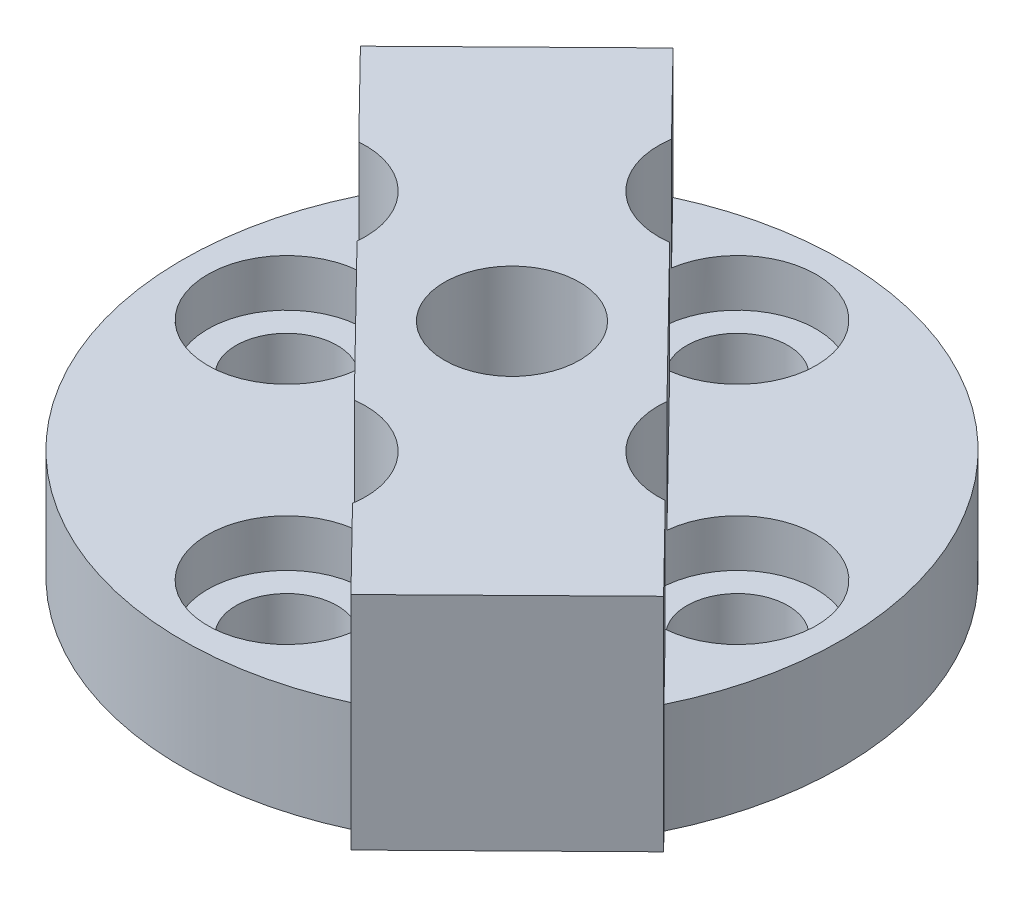
ISO-10303-21;
HEADER;
FILE_DESCRIPTION(('STEP AP214'),'2;1');
FILE_NAME('part.step','',(''),(''),'','','');
FILE_SCHEMA(('AUTOMOTIVE_DESIGN { 1 0 10303 214 1 1 1 1 }'));
ENDSEC;
DATA;
#1=APPLICATION_CONTEXT('core data for automotive mechanical design processes');
#2=APPLICATION_PROTOCOL_DEFINITION('international standard','automotive_design',2000,#1);
#3=PRODUCT_CONTEXT('',#1,'mechanical');
#4=PRODUCT('Part','Part','',(#3));
#5=PRODUCT_RELATED_PRODUCT_CATEGORY('part','',(#4));
#6=PRODUCT_DEFINITION_FORMATION('','',#4);
#7=PRODUCT_DEFINITION_CONTEXT('part definition',#1,'design');
#8=PRODUCT_DEFINITION('design','',#6,#7);
#9=PRODUCT_DEFINITION_SHAPE('','',#8);
#10=(LENGTH_UNIT() NAMED_UNIT(*) SI_UNIT(.MILLI.,.METRE.));
#11=(NAMED_UNIT(*) PLANE_ANGLE_UNIT() SI_UNIT($,.RADIAN.));
#12=(NAMED_UNIT(*) SI_UNIT($,.STERADIAN.) SOLID_ANGLE_UNIT());
#13=UNCERTAINTY_MEASURE_WITH_UNIT(LENGTH_MEASURE(1.E-05),#10,'distance_accuracy_value','');
#14=(GEOMETRIC_REPRESENTATION_CONTEXT(3) GLOBAL_UNCERTAINTY_ASSIGNED_CONTEXT((#13)) GLOBAL_UNIT_ASSIGNED_CONTEXT((#10,
#11,#12)) REPRESENTATION_CONTEXT('',''));
#15=CARTESIAN_POINT('',(0.,0.,0.));
#16=DIRECTION('',(0.,0.,1.));
#17=DIRECTION('',(1.,0.,0.));
#18=AXIS2_PLACEMENT_3D('',#15,#16,#17);
#19=CARTESIAN_POINT('',(0.,6.1849,-12.7));
#20=DIRECTION('',(0.,-1.,0.));
#21=DIRECTION('',(0.,0.,-1.));
#22=AXIS2_PLACEMENT_3D('',#19,#20,#21);
#23=CYLINDRICAL_SURFACE('',#22,2.85115);
#24=CARTESIAN_POINT('',(0.,0.,-12.7));
#25=DIRECTION('',(0.,1.,0.));
#26=DIRECTION('',(0.,0.,1.));
#27=AXIS2_PLACEMENT_3D('',#24,#25,#26);
#28=CIRCLE('',#27,2.85115);
#29=CARTESIAN_POINT('',(0.,0.,-9.84885));
#30=VERTEX_POINT('',#29);
#31=EDGE_CURVE('E227',#30,#30,#28,.T.);
#32=ORIENTED_EDGE('',*,*,#31,.F.);
#33=EDGE_LOOP('',(#32));
#34=FACE_BOUND('',#33,.T.);
#35=CARTESIAN_POINT('',(0.,3.5179,-12.7));
#36=DIRECTION('',(0.,1.,0.));
#37=DIRECTION('',(0.,0.,1.));
#38=AXIS2_PLACEMENT_3D('',#35,#36,#37);
#39=CIRCLE('',#38,2.85115);
#40=CARTESIAN_POINT('',(0.,3.5179,-9.84885));
#41=VERTEX_POINT('',#40);
#42=EDGE_CURVE('E40',#41,#41,#39,.T.);
#43=ORIENTED_EDGE('',*,*,#42,.T.);
#44=EDGE_LOOP('',(#43));
#45=FACE_BOUND('',#44,.T.);
#46=ADVANCED_FACE('F36',(#34,#45),#23,.F.);
#47=CARTESIAN_POINT('',(-12.7,6.1849,0.));
#48=DIRECTION('',(0.,-1.,0.));
#49=DIRECTION('',(0.,0.,-1.));
#50=AXIS2_PLACEMENT_3D('',#47,#48,#49);
#51=CYLINDRICAL_SURFACE('',#50,2.85115);
#52=CARTESIAN_POINT('',(-12.7,0.,0.));
#53=DIRECTION('',(0.,1.,0.));
#54=DIRECTION('',(0.,0.,1.));
#55=AXIS2_PLACEMENT_3D('',#52,#53,#54);
#56=CIRCLE('',#55,2.85115);
#57=CARTESIAN_POINT('',(-12.7,0.,2.85115));
#58=VERTEX_POINT('',#57);
#59=EDGE_CURVE('E224',#58,#58,#56,.T.);
#60=ORIENTED_EDGE('',*,*,#59,.F.);
#61=EDGE_LOOP('',(#60));
#62=FACE_BOUND('',#61,.T.);
#63=CARTESIAN_POINT('',(-12.7,3.5179,0.));
#64=DIRECTION('',(0.,1.,0.));
#65=DIRECTION('',(0.,0.,1.));
#66=AXIS2_PLACEMENT_3D('',#63,#64,#65);
#67=CIRCLE('',#66,2.85115);
#68=CARTESIAN_POINT('',(-12.7,3.5179,2.85115));
#69=VERTEX_POINT('',#68);
#70=EDGE_CURVE('E252',#69,#69,#67,.T.);
#71=ORIENTED_EDGE('',*,*,#70,.T.);
#72=EDGE_LOOP('',(#71));
#73=FACE_BOUND('',#72,.T.);
#74=ADVANCED_FACE('F385',(#62,#73),#51,.F.);
#75=CARTESIAN_POINT('',(12.7,6.1849,0.));
#76=DIRECTION('',(0.,-1.,0.));
#77=DIRECTION('',(0.,0.,-1.));
#78=AXIS2_PLACEMENT_3D('',#75,#76,#77);
#79=CYLINDRICAL_SURFACE('',#78,2.85115);
#80=CARTESIAN_POINT('',(12.7,0.,0.));
#81=DIRECTION('',(0.,1.,0.));
#82=DIRECTION('',(0.,0.,1.));
#83=AXIS2_PLACEMENT_3D('',#80,#81,#82);
#84=CIRCLE('',#83,2.85115);
#85=CARTESIAN_POINT('',(12.7,0.,2.85115));
#86=VERTEX_POINT('',#85);
#87=EDGE_CURVE('E218',#86,#86,#84,.T.);
#88=ORIENTED_EDGE('',*,*,#87,.F.);
#89=EDGE_LOOP('',(#88));
#90=FACE_BOUND('',#89,.T.);
#91=CARTESIAN_POINT('',(12.7,3.5179,0.));
#92=DIRECTION('',(0.,1.,0.));
#93=DIRECTION('',(0.,0.,1.));
#94=AXIS2_PLACEMENT_3D('',#91,#92,#93);
#95=CIRCLE('',#94,2.85115);
#96=CARTESIAN_POINT('',(12.7,3.5179,2.85115));
#97=VERTEX_POINT('',#96);
#98=EDGE_CURVE('E250',#97,#97,#95,.T.);
#99=ORIENTED_EDGE('',*,*,#98,.T.);
#100=EDGE_LOOP('',(#99));
#101=FACE_BOUND('',#100,.T.);
#102=ADVANCED_FACE('F391',(#90,#101),#79,.F.);
#103=CARTESIAN_POINT('',(0.,6.1849,12.7));
#104=DIRECTION('',(0.,-1.,0.));
#105=DIRECTION('',(0.,0.,-1.));
#106=AXIS2_PLACEMENT_3D('',#103,#104,#105);
#107=CYLINDRICAL_SURFACE('',#106,2.85115);
#108=CARTESIAN_POINT('',(0.,0.,12.7));
#109=DIRECTION('',(0.,1.,0.));
#110=DIRECTION('',(0.,0.,1.));
#111=AXIS2_PLACEMENT_3D('',#108,#109,#110);
#112=CIRCLE('',#111,2.85115);
#113=CARTESIAN_POINT('',(0.,0.,15.55115));
#114=VERTEX_POINT('',#113);
#115=EDGE_CURVE('E221',#114,#114,#112,.T.);
#116=ORIENTED_EDGE('',*,*,#115,.F.);
#117=EDGE_LOOP('',(#116));
#118=FACE_BOUND('',#117,.T.);
#119=CARTESIAN_POINT('',(0.,3.5179,12.7));
#120=DIRECTION('',(0.,1.,0.));
#121=DIRECTION('',(0.,0.,1.));
#122=AXIS2_PLACEMENT_3D('',#119,#120,#121);
#123=CIRCLE('',#122,2.85115);
#124=CARTESIAN_POINT('',(0.,3.5179,15.55115));
#125=VERTEX_POINT('',#124);
#126=EDGE_CURVE('E245',#125,#125,#123,.T.);
#127=ORIENTED_EDGE('',*,*,#126,.T.);
#128=EDGE_LOOP('',(#127));
#129=FACE_BOUND('',#128,.T.);
#130=ADVANCED_FACE('F398',(#118,#129),#107,.F.);
#131=CARTESIAN_POINT('',(0.,6.1849,0.));
#132=DIRECTION('',(0.,1.,0.));
#133=DIRECTION('',(0.,0.,1.));
#134=AXIS2_PLACEMENT_3D('',#131,#132,#133);
#135=PLANE('',#134);
#136=CARTESIAN_POINT('',(-12.7,6.1849,0.));
#137=DIRECTION('',(0.,1.,0.));
#138=DIRECTION('',(-1.,0.,0.));
#139=AXIS2_PLACEMENT_3D('',#136,#137,#138);
#140=CIRCLE('',#139,4.445);
#141=CARTESIAN_POINT('',(-13.0655182023524,6.1849,-4.42994598654989));
#142=VERTEX_POINT('',#141);
#143=CARTESIAN_POINT('',(-8.27822581334419,6.1849,0.453803968938508));
#144=VERTEX_POINT('',#143);
#145=EDGE_CURVE('E53',#142,#144,#140,.T.);
#146=ORIENTED_EDGE('',*,*,#145,.F.);
#147=DIRECTION('',(-0.700019383917378,0.,-0.714123842299034));
#148=VECTOR('',#147,1.);
#149=CARTESIAN_POINT('',(-4.44852735702548,6.1849,4.36066574920571));
#150=LINE('',#149,#148);
#151=CARTESIAN_POINT('',(-16.6974542078552,6.1849,-8.13506066597414));
#152=VERTEX_POINT('',#151);
#153=EDGE_CURVE('E177',#142,#152,#150,.T.);
#154=ORIENTED_EDGE('',*,*,#153,.T.);
#155=CARTESIAN_POINT('',(0.,6.1849,0.));
#156=DIRECTION('',(0.,1.,0.));
#157=DIRECTION('',(0.,0.,1.));
#158=AXIS2_PLACEMENT_3D('',#155,#156,#157);
#159=CIRCLE('',#158,18.57375);
#160=CARTESIAN_POINT('',(7.80039949380421,6.1849,16.8563921643856));
#161=VERTEX_POINT('',#160);
#162=EDGE_CURVE('E231',#152,#161,#159,.T.);
#163=ORIENTED_EDGE('',*,*,#162,.T.);
#164=DIRECTION('',(-0.700019383917377,0.,-0.714123842299034));
#165=VECTOR('',#164,1.);
#166=CARTESIAN_POINT('',(-4.44852735702547,6.1849,4.3606657492057));
#167=LINE('',#166,#165);
#168=CARTESIAN_POINT('',(4.39267720418578,6.1849,13.3800088086389));
#169=VERTEX_POINT('',#168);
#170=EDGE_CURVE('E214',#161,#169,#167,.T.);
#171=ORIENTED_EDGE('',*,*,#170,.T.);
#172=CARTESIAN_POINT('',(0.,6.1849,12.7));
#173=DIRECTION('',(0.,1.,0.));
#174=DIRECTION('',(0.,0.,1.));
#175=AXIS2_PLACEMENT_3D('',#172,#173,#174);
#176=CIRCLE('',#175,4.445);
#177=CARTESIAN_POINT('',(-0.592258402213985,6.1849,8.29463338812682));
#178=VERTEX_POINT('',#177);
#179=EDGE_CURVE('E61',#178,#169,#176,.T.);
#180=ORIENTED_EDGE('',*,*,#179,.F.);
#181=DIRECTION('',(-0.700019383917378,0.,-0.714123842299034));
#182=VECTOR('',#181,1.);
#183=CARTESIAN_POINT('',(-4.44852735702548,6.1849,4.36066574920571));
#184=LINE('',#183,#182);
#185=EDGE_CURVE('E176',#178,#144,#184,.T.);
#186=ORIENTED_EDGE('',*,*,#185,.T.);
#187=EDGE_LOOP('',(#146,#154,#163,#171,#180,#186));
#188=FACE_BOUND('',#187,.T.);
#189=ADVANCED_FACE('F353',(#188),#135,.T.);
#190=CARTESIAN_POINT('',(0.,6.1849,-12.7));
#191=DIRECTION('',(0.,1.,0.));
#192=DIRECTION('',(0.,0.,-1.));
#193=AXIS2_PLACEMENT_3D('',#190,#191,#192);
#194=CIRCLE('',#193,4.445);
#195=CARTESIAN_POINT('',(0.592258402214007,6.1849,-8.29463338812683));
#196=VERTEX_POINT('',#195);
#197=CARTESIAN_POINT('',(-4.39267720418578,6.1849,-13.380008808639));
#198=VERTEX_POINT('',#197);
#199=EDGE_CURVE('E153',#196,#198,#194,.T.);
#200=ORIENTED_EDGE('',*,*,#199,.F.);
#201=DIRECTION('',(0.700019383917378,0.,0.714123842299034));
#202=VECTOR('',#201,1.);
#203=CARTESIAN_POINT('',(4.44852735702549,6.1849,-4.36066574920572));
#204=LINE('',#203,#202);
#205=CARTESIAN_POINT('',(8.27822581334419,6.1849,-0.453803968938533));
#206=VERTEX_POINT('',#205);
#207=EDGE_CURVE('E156',#196,#206,#204,.T.);
#208=ORIENTED_EDGE('',*,*,#207,.T.);
#209=CARTESIAN_POINT('',(12.7,6.1849,1.33025439009923E-13));
#210=DIRECTION('',(0.,1.,0.));
#211=DIRECTION('',(1.,0.,0.));
#212=AXIS2_PLACEMENT_3D('',#209,#210,#211);
#213=CIRCLE('',#212,4.445);
#214=CARTESIAN_POINT('',(13.0655182023525,6.1849,4.42994598654997));
#215=VERTEX_POINT('',#214);
#216=EDGE_CURVE('E330',#215,#206,#213,.T.);
#217=ORIENTED_EDGE('',*,*,#216,.F.);
#218=DIRECTION('',(0.700019383917373,0.,0.714123842299038));
#219=VECTOR('',#218,1.);
#220=CARTESIAN_POINT('',(4.44852735702558,6.1849,-4.36066574920575));
#221=LINE('',#220,#219);
#222=CARTESIAN_POINT('',(16.6974542078552,6.1849,8.13506066597415));
#223=VERTEX_POINT('',#222);
#224=EDGE_CURVE('E212',#215,#223,#221,.T.);
#225=ORIENTED_EDGE('',*,*,#224,.T.);
#226=CARTESIAN_POINT('',(-7.80039949380419,6.1849,-16.8563921643856));
#227=VERTEX_POINT('',#226);
#228=EDGE_CURVE('E234',#223,#227,#159,.T.);
#229=ORIENTED_EDGE('',*,*,#228,.T.);
#230=DIRECTION('',(0.700019383917377,0.,0.714123842299034));
#231=VECTOR('',#230,1.);
#232=CARTESIAN_POINT('',(4.44852735702549,6.1849,-4.36066574920571));
#233=LINE('',#232,#231);
#234=EDGE_CURVE('E160',#227,#198,#233,.T.);
#235=ORIENTED_EDGE('',*,*,#234,.T.);
#236=EDGE_LOOP('',(#200,#208,#217,#225,#229,#235));
#237=FACE_BOUND('',#236,.T.);
#238=ADVANCED_FACE('F155',(#237),#135,.T.);
#239=CARTESIAN_POINT('',(0.,6.1849,0.));
#240=DIRECTION('',(0.,-1.,0.));
#241=DIRECTION('',(0.,0.,-1.));
#242=AXIS2_PLACEMENT_3D('',#239,#240,#241);
#243=CYLINDRICAL_SURFACE('',#242,18.57375);
#244=DIRECTION('',(0.,-1.,0.));
#245=VECTOR('',#244,1.);
#246=CARTESIAN_POINT('',(-16.6974542078552,6.1849,-8.13506066597414));
#247=LINE('',#246,#245);
#248=CARTESIAN_POINT('',(-16.6974542078552,0.,-8.13506066597414));
#249=VERTEX_POINT('',#248);
#250=EDGE_CURVE('E11',#249,#152,#247,.F.);
#251=ORIENTED_EDGE('',*,*,#250,.F.);
#252=CARTESIAN_POINT('',(0.,0.,0.));
#253=DIRECTION('',(0.,1.,0.));
#254=DIRECTION('',(0.,0.,1.));
#255=AXIS2_PLACEMENT_3D('',#252,#253,#254);
#256=CIRCLE('',#255,18.57375);
#257=CARTESIAN_POINT('',(7.80039949380421,0.,16.8563921643856));
#258=VERTEX_POINT('',#257);
#259=EDGE_CURVE('E230',#249,#258,#256,.T.);
#260=ORIENTED_EDGE('',*,*,#259,.T.);
#261=DIRECTION('',(0.,-1.,0.));
#262=VECTOR('',#261,1.);
#263=CARTESIAN_POINT('',(7.80039949380421,6.1849,16.8563921643856));
#264=LINE('',#263,#262);
#265=EDGE_CURVE('E45',#161,#258,#264,.T.);
#266=ORIENTED_EDGE('',*,*,#265,.F.);
#267=ORIENTED_EDGE('',*,*,#162,.F.);
#268=EDGE_LOOP('',(#251,#260,#266,#267));
#269=FACE_BOUND('',#268,.T.);
#270=ADVANCED_FACE('F38',(#269),#243,.T.);
#271=DIRECTION('',(0.,-1.,0.));
#272=VECTOR('',#271,1.);
#273=CARTESIAN_POINT('',(16.6974542078552,6.1849,8.13506066597415));
#274=LINE('',#273,#272);
#275=CARTESIAN_POINT('',(16.6974542078552,0.,8.13506066597415));
#276=VERTEX_POINT('',#275);
#277=EDGE_CURVE('E240',#276,#223,#274,.F.);
#278=ORIENTED_EDGE('',*,*,#277,.F.);
#279=CARTESIAN_POINT('',(-7.80039949380419,0.,-16.8563921643856));
#280=VERTEX_POINT('',#279);
#281=EDGE_CURVE('E235',#276,#280,#256,.T.);
#282=ORIENTED_EDGE('',*,*,#281,.T.);
#283=DIRECTION('',(0.,-1.,0.));
#284=VECTOR('',#283,1.);
#285=CARTESIAN_POINT('',(-7.80039949380419,6.1849,-16.8563921643856));
#286=LINE('',#285,#284);
#287=EDGE_CURVE('E237',#227,#280,#286,.T.);
#288=ORIENTED_EDGE('',*,*,#287,.F.);
#289=ORIENTED_EDGE('',*,*,#228,.F.);
#290=EDGE_LOOP('',(#278,#282,#288,#289));
#291=FACE_BOUND('',#290,.T.);
#292=ADVANCED_FACE('F328',(#291),#243,.T.);
#293=CARTESIAN_POINT('',(0.,0.,0.));
#294=DIRECTION('',(0.,1.,0.));
#295=DIRECTION('',(0.,0.,1.));
#296=AXIS2_PLACEMENT_3D('',#293,#294,#295);
#297=PLANE('',#296);
#298=CARTESIAN_POINT('',(0.,0.,0.));
#299=DIRECTION('',(0.,1.,0.));
#300=DIRECTION('',(0.,0.,1.));
#301=AXIS2_PLACEMENT_3D('',#298,#299,#300);
#302=CIRCLE('',#301,3.175);
#303=CARTESIAN_POINT('',(0.,0.,3.175));
#304=VERTEX_POINT('',#303);
#305=EDGE_CURVE('E408',#304,#304,#302,.T.);
#306=ORIENTED_EDGE('',*,*,#305,.T.);
#307=EDGE_LOOP('',(#306));
#308=FACE_BOUND('',#307,.T.);
#309=ORIENTED_EDGE('',*,*,#259,.F.);
#310=DIRECTION('',(0.700019383917378,0.,0.714123842299034));
#311=VECTOR('',#310,1.);
#312=CARTESIAN_POINT('',(-17.694994158894,0.,-9.1526997186189));
#313=LINE('',#312,#311);
#314=CARTESIAN_POINT('',(-17.694994158894,0.,-9.1526997186189));
#315=VERTEX_POINT('',#314);
#316=EDGE_CURVE('E292',#315,#249,#313,.T.);
#317=ORIENTED_EDGE('',*,*,#316,.F.);
#318=DIRECTION('',(-0.714123842299034,0.,0.700019383917377));
#319=VECTOR('',#318,1.);
#320=CARTESIAN_POINT('',(-8.79793944484304,0.,-17.8740312170303));
#321=LINE('',#320,#319);
#322=CARTESIAN_POINT('',(-8.79793944484304,0.,-17.8740312170303));
#323=VERTEX_POINT('',#322);
#324=EDGE_CURVE('E248',#323,#315,#321,.T.);
#325=ORIENTED_EDGE('',*,*,#324,.F.);
#326=DIRECTION('',(-0.700019383917377,0.,-0.714123842299034));
#327=VECTOR('',#326,1.);
#328=CARTESIAN_POINT('',(-8.79793944484304,0.,-17.8740312170303));
#329=LINE('',#328,#327);
#330=EDGE_CURVE('E269',#280,#323,#329,.T.);
#331=ORIENTED_EDGE('',*,*,#330,.F.);
#332=ORIENTED_EDGE('',*,*,#281,.F.);
#333=DIRECTION('',(-0.700019383917373,0.,-0.714123842299038));
#334=VECTOR('',#333,1.);
#335=CARTESIAN_POINT('',(13.0655182023524,0.,4.42994598654984));
#336=LINE('',#335,#334);
#337=CARTESIAN_POINT('',(17.694994158894,0.,9.15269971861892));
#338=VERTEX_POINT('',#337);
#339=EDGE_CURVE('E299',#338,#276,#336,.T.);
#340=ORIENTED_EDGE('',*,*,#339,.F.);
#341=DIRECTION('',(0.714123842299034,0.,-0.700019383917377));
#342=VECTOR('',#341,1.);
#343=CARTESIAN_POINT('',(17.694994158894,0.,9.15269971861892));
#344=LINE('',#343,#342);
#345=CARTESIAN_POINT('',(8.79793944484305,0.,17.8740312170303));
#346=VERTEX_POINT('',#345);
#347=EDGE_CURVE('E297',#346,#338,#344,.T.);
#348=ORIENTED_EDGE('',*,*,#347,.F.);
#349=DIRECTION('',(0.700019383917377,0.,0.714123842299034));
#350=VECTOR('',#349,1.);
#351=CARTESIAN_POINT('',(4.39267720418578,0.,13.3800088086389));
#352=LINE('',#351,#350);
#353=EDGE_CURVE('E295',#258,#346,#352,.T.);
#354=ORIENTED_EDGE('',*,*,#353,.F.);
#355=EDGE_LOOP('',(#309,#317,#325,#331,#332,#340,#348,#354));
#356=FACE_BOUND('',#355,.T.);
#357=ORIENTED_EDGE('',*,*,#87,.T.);
#358=EDGE_LOOP('',(#357));
#359=FACE_BOUND('',#358,.T.);
#360=ORIENTED_EDGE('',*,*,#31,.T.);
#361=EDGE_LOOP('',(#360));
#362=FACE_BOUND('',#361,.T.);
#363=ORIENTED_EDGE('',*,*,#115,.T.);
#364=EDGE_LOOP('',(#363));
#365=FACE_BOUND('',#364,.T.);
#366=ORIENTED_EDGE('',*,*,#59,.T.);
#367=EDGE_LOOP('',(#366));
#368=FACE_BOUND('',#367,.T.);
#369=ADVANCED_FACE('F313',(#308,#356,#359,#362,#365,#368),#297,.F.);
#370=CARTESIAN_POINT('',(-8.79793944484304,12.4714,-17.8740312170303));
#371=DIRECTION('',(0.700019383917377,0.,0.714123842299034));
#372=DIRECTION('',(0.714123842299034,0.,-0.700019383917377));
#373=AXIS2_PLACEMENT_3D('',#370,#371,#372);
#374=PLANE('',#373);
#375=ORIENTED_EDGE('',*,*,#324,.T.);
#376=DIRECTION('',(0.,-1.,0.));
#377=VECTOR('',#376,1.);
#378=CARTESIAN_POINT('',(-17.694994158894,12.4714,-9.1526997186189));
#379=LINE('',#378,#377);
#380=CARTESIAN_POINT('',(-17.694994158894,12.4714,-9.1526997186189));
#381=VERTEX_POINT('',#380);
#382=EDGE_CURVE('E208',#381,#315,#379,.T.);
#383=ORIENTED_EDGE('',*,*,#382,.F.);
#384=DIRECTION('',(-0.714123842299034,0.,0.700019383917377));
#385=VECTOR('',#384,1.);
#386=CARTESIAN_POINT('',(-8.79793944484304,12.4714,-17.8740312170303));
#387=LINE('',#386,#385);
#388=CARTESIAN_POINT('',(-8.79793944484304,12.4714,-17.8740312170303));
#389=VERTEX_POINT('',#388);
#390=EDGE_CURVE('E265',#389,#381,#387,.T.);
#391=ORIENTED_EDGE('',*,*,#390,.F.);
#392=DIRECTION('',(0.,-1.,0.));
#393=VECTOR('',#392,1.);
#394=CARTESIAN_POINT('',(-8.79793944484304,12.4714,-17.8740312170303));
#395=LINE('',#394,#393);
#396=EDGE_CURVE('E186',#389,#323,#395,.T.);
#397=ORIENTED_EDGE('',*,*,#396,.T.);
#398=EDGE_LOOP('',(#375,#383,#391,#397));
#399=FACE_BOUND('',#398,.T.);
#400=ADVANCED_FACE('F307',(#399),#374,.F.);
#401=CARTESIAN_POINT('',(-17.694994158894,12.4714,-9.1526997186189));
#402=DIRECTION('',(0.714123842299034,0.,-0.700019383917378));
#403=DIRECTION('',(-0.700019383917378,0.,-0.714123842299034));
#404=AXIS2_PLACEMENT_3D('',#401,#402,#403);
#405=PLANE('',#404);
#406=ORIENTED_EDGE('',*,*,#153,.F.);
#407=DIRECTION('',(0.,-1.,0.));
#408=VECTOR('',#407,1.);
#409=CARTESIAN_POINT('',(-13.0655182023524,12.4714,-4.42994598654984));
#410=LINE('',#409,#408);
#411=CARTESIAN_POINT('',(-13.0655182023524,12.4714,-4.42994598654984));
#412=VERTEX_POINT('',#411);
#413=EDGE_CURVE('E206',#412,#142,#410,.T.);
#414=ORIENTED_EDGE('',*,*,#413,.F.);
#415=DIRECTION('',(0.700019383917378,0.,0.714123842299034));
#416=VECTOR('',#415,1.);
#417=CARTESIAN_POINT('',(-17.694994158894,12.4714,-9.1526997186189));
#418=LINE('',#417,#416);
#419=EDGE_CURVE('E268',#381,#412,#418,.T.);
#420=ORIENTED_EDGE('',*,*,#419,.F.);
#421=ORIENTED_EDGE('',*,*,#382,.T.);
#422=ORIENTED_EDGE('',*,*,#316,.T.);
#423=ORIENTED_EDGE('',*,*,#250,.T.);
#424=EDGE_LOOP('',(#406,#414,#420,#421,#422,#423));
#425=FACE_BOUND('',#424,.T.);
#426=ADVANCED_FACE('F320',(#425),#405,.F.);
#427=CARTESIAN_POINT('',(-12.7,12.4714,0.));
#428=DIRECTION('',(0.,-1.,0.));
#429=DIRECTION('',(0.,0.,-1.));
#430=AXIS2_PLACEMENT_3D('',#427,#428,#429);
#431=CYLINDRICAL_SURFACE('',#430,4.445);
#432=ORIENTED_EDGE('',*,*,#413,.T.);
#433=ORIENTED_EDGE('',*,*,#145,.T.);
#434=DIRECTION('',(0.,-1.,0.));
#435=VECTOR('',#434,1.);
#436=CARTESIAN_POINT('',(-8.27822581334419,12.4714,0.453803968938508));
#437=LINE('',#436,#435);
#438=CARTESIAN_POINT('',(-8.27822581334419,12.4714,0.453803968938508));
#439=VERTEX_POINT('',#438);
#440=EDGE_CURVE('E203',#439,#144,#437,.T.);
#441=ORIENTED_EDGE('',*,*,#440,.F.);
#442=CARTESIAN_POINT('',(-12.7,12.4714,0.));
#443=DIRECTION('',(0.,-1.,0.));
#444=DIRECTION('',(0.,0.,1.));
#445=AXIS2_PLACEMENT_3D('',#442,#443,#444);
#446=CIRCLE('',#445,4.445);
#447=EDGE_CURVE('E271',#412,#439,#446,.T.);
#448=ORIENTED_EDGE('',*,*,#447,.F.);
#449=EDGE_LOOP('',(#432,#433,#441,#448));
#450=FACE_BOUND('',#449,.T.);
#451=CARTESIAN_POINT('',(-12.7,3.5179,0.));
#452=DIRECTION('',(0.,1.,0.));
#453=DIRECTION('',(-1.,0.,0.));
#454=AXIS2_PLACEMENT_3D('',#451,#452,#453);
#455=CIRCLE('',#454,4.445);
#456=CARTESIAN_POINT('',(-17.145,3.5179,0.));
#457=VERTEX_POINT('',#456);
#458=EDGE_CURVE('E253',#457,#457,#455,.T.);
#459=ORIENTED_EDGE('',*,*,#458,.F.);
#460=EDGE_LOOP('',(#459));
#461=FACE_BOUND('',#460,.T.);
#462=ADVANCED_FACE('F354',(#450,#461),#431,.F.);
#463=CARTESIAN_POINT('',(-8.27822581334419,12.4714,0.453803968938508));
#464=DIRECTION('',(0.714123842299034,0.,-0.700019383917378));
#465=DIRECTION('',(-0.700019383917378,0.,-0.714123842299034));
#466=AXIS2_PLACEMENT_3D('',#463,#464,#465);
#467=PLANE('',#466);
#468=ORIENTED_EDGE('',*,*,#185,.F.);
#469=DIRECTION('',(0.,-1.,0.));
#470=VECTOR('',#469,1.);
#471=CARTESIAN_POINT('',(-0.592258402213985,12.4714,8.29463338812682));
#472=LINE('',#471,#470);
#473=CARTESIAN_POINT('',(-0.592258402213985,12.4714,8.29463338812682));
#474=VERTEX_POINT('',#473);
#475=EDGE_CURVE('E201',#474,#178,#472,.T.);
#476=ORIENTED_EDGE('',*,*,#475,.F.);
#477=DIRECTION('',(0.700019383917378,0.,0.714123842299034));
#478=VECTOR('',#477,1.);
#479=CARTESIAN_POINT('',(-8.27822581334419,12.4714,0.453803968938508));
#480=LINE('',#479,#478);
#481=EDGE_CURVE('E273',#439,#474,#480,.T.);
#482=ORIENTED_EDGE('',*,*,#481,.F.);
#483=ORIENTED_EDGE('',*,*,#440,.T.);
#484=EDGE_LOOP('',(#468,#476,#482,#483));
#485=FACE_BOUND('',#484,.T.);
#486=ADVANCED_FACE('F361',(#485),#467,.F.);
#487=CARTESIAN_POINT('',(0.,12.4714,12.7));
#488=DIRECTION('',(0.,-1.,0.));
#489=DIRECTION('',(0.,0.,-1.));
#490=AXIS2_PLACEMENT_3D('',#487,#488,#489);
#491=CYLINDRICAL_SURFACE('',#490,4.445);
#492=ORIENTED_EDGE('',*,*,#475,.T.);
#493=ORIENTED_EDGE('',*,*,#179,.T.);
#494=DIRECTION('',(0.,-1.,0.));
#495=VECTOR('',#494,1.);
#496=CARTESIAN_POINT('',(4.39267720418578,12.4714,13.3800088086389));
#497=LINE('',#496,#495);
#498=CARTESIAN_POINT('',(4.39267720418578,12.4714,13.3800088086389));
#499=VERTEX_POINT('',#498);
#500=EDGE_CURVE('E198',#499,#169,#497,.T.);
#501=ORIENTED_EDGE('',*,*,#500,.F.);
#502=CARTESIAN_POINT('',(0.,12.4714,12.7));
#503=DIRECTION('',(0.,-1.,0.));
#504=DIRECTION('',(0.,0.,1.));
#505=AXIS2_PLACEMENT_3D('',#502,#503,#504);
#506=CIRCLE('',#505,4.445);
#507=EDGE_CURVE('E275',#474,#499,#506,.T.);
#508=ORIENTED_EDGE('',*,*,#507,.F.);
#509=EDGE_LOOP('',(#492,#493,#501,#508));
#510=FACE_BOUND('',#509,.T.);
#511=CARTESIAN_POINT('',(0.,3.5179,12.7));
#512=DIRECTION('',(0.,1.,0.));
#513=DIRECTION('',(0.,0.,1.));
#514=AXIS2_PLACEMENT_3D('',#511,#512,#513);
#515=CIRCLE('',#514,4.445);
#516=CARTESIAN_POINT('',(0.,3.5179,17.145));
#517=VERTEX_POINT('',#516);
#518=EDGE_CURVE('E249',#517,#517,#515,.T.);
#519=ORIENTED_EDGE('',*,*,#518,.F.);
#520=EDGE_LOOP('',(#519));
#521=FACE_BOUND('',#520,.T.);
#522=ADVANCED_FACE('F362',(#510,#521),#491,.F.);
#523=CARTESIAN_POINT('',(4.39267720418578,12.4714,13.3800088086389));
#524=DIRECTION('',(0.714123842299034,0.,-0.700019383917377));
#525=DIRECTION('',(-0.700019383917377,0.,-0.714123842299034));
#526=AXIS2_PLACEMENT_3D('',#523,#524,#525);
#527=PLANE('',#526);
#528=ORIENTED_EDGE('',*,*,#170,.F.);
#529=ORIENTED_EDGE('',*,*,#265,.T.);
#530=ORIENTED_EDGE('',*,*,#353,.T.);
#531=DIRECTION('',(0.,-1.,0.));
#532=VECTOR('',#531,1.);
#533=CARTESIAN_POINT('',(8.79793944484305,12.4714,17.8740312170303));
#534=LINE('',#533,#532);
#535=CARTESIAN_POINT('',(8.79793944484305,12.4714,17.8740312170303));
#536=VERTEX_POINT('',#535);
#537=EDGE_CURVE('E195',#536,#346,#534,.T.);
#538=ORIENTED_EDGE('',*,*,#537,.F.);
#539=DIRECTION('',(0.700019383917377,0.,0.714123842299034));
#540=VECTOR('',#539,1.);
#541=CARTESIAN_POINT('',(4.39267720418578,12.4714,13.3800088086389));
#542=LINE('',#541,#540);
#543=EDGE_CURVE('E277',#499,#536,#542,.T.);
#544=ORIENTED_EDGE('',*,*,#543,.F.);
#545=ORIENTED_EDGE('',*,*,#500,.T.);
#546=EDGE_LOOP('',(#528,#529,#530,#538,#544,#545));
#547=FACE_BOUND('',#546,.T.);
#548=ADVANCED_FACE('F349',(#547),#527,.F.);
#549=CARTESIAN_POINT('',(17.694994158894,12.4714,9.15269971861892));
#550=DIRECTION('',(-0.700019383917377,0.,-0.714123842299034));
#551=DIRECTION('',(-0.714123842299034,0.,0.700019383917377));
#552=AXIS2_PLACEMENT_3D('',#549,#550,#551);
#553=PLANE('',#552);
#554=ORIENTED_EDGE('',*,*,#347,.T.);
#555=DIRECTION('',(0.,-1.,0.));
#556=VECTOR('',#555,1.);
#557=CARTESIAN_POINT('',(17.694994158894,12.4714,9.15269971861892));
#558=LINE('',#557,#556);
#559=CARTESIAN_POINT('',(17.694994158894,12.4714,9.15269971861892));
#560=VERTEX_POINT('',#559);
#561=EDGE_CURVE('E192',#560,#338,#558,.T.);
#562=ORIENTED_EDGE('',*,*,#561,.F.);
#563=DIRECTION('',(0.714123842299034,0.,-0.700019383917377));
#564=VECTOR('',#563,1.);
#565=CARTESIAN_POINT('',(17.694994158894,12.4714,9.15269971861892));
#566=LINE('',#565,#564);
#567=EDGE_CURVE('E279',#536,#560,#566,.T.);
#568=ORIENTED_EDGE('',*,*,#567,.F.);
#569=ORIENTED_EDGE('',*,*,#537,.T.);
#570=EDGE_LOOP('',(#554,#562,#568,#569));
#571=FACE_BOUND('',#570,.T.);
#572=ADVANCED_FACE('F344',(#571),#553,.F.);
#573=CARTESIAN_POINT('',(13.0655182023524,12.4714,4.42994598654984));
#574=DIRECTION('',(-0.714123842299038,0.,0.700019383917373));
#575=DIRECTION('',(0.700019383917373,0.,0.714123842299038));
#576=AXIS2_PLACEMENT_3D('',#573,#574,#575);
#577=PLANE('',#576);
#578=ORIENTED_EDGE('',*,*,#224,.F.);
#579=DIRECTION('',(0.,-1.,0.));
#580=VECTOR('',#579,1.);
#581=CARTESIAN_POINT('',(13.0655182023524,12.4714,4.42994598654984));
#582=LINE('',#581,#580);
#583=CARTESIAN_POINT('',(13.0655182023524,12.4714,4.42994598654984));
#584=VERTEX_POINT('',#583);
#585=EDGE_CURVE('E184',#584,#215,#582,.T.);
#586=ORIENTED_EDGE('',*,*,#585,.F.);
#587=DIRECTION('',(-0.700019383917373,0.,-0.714123842299038));
#588=VECTOR('',#587,1.);
#589=CARTESIAN_POINT('',(13.0655182023524,12.4714,4.42994598654984));
#590=LINE('',#589,#588);
#591=EDGE_CURVE('E281',#560,#584,#590,.T.);
#592=ORIENTED_EDGE('',*,*,#591,.F.);
#593=ORIENTED_EDGE('',*,*,#561,.T.);
#594=ORIENTED_EDGE('',*,*,#339,.T.);
#595=ORIENTED_EDGE('',*,*,#277,.T.);
#596=EDGE_LOOP('',(#578,#586,#592,#593,#594,#595));
#597=FACE_BOUND('',#596,.T.);
#598=ADVANCED_FACE('F333',(#597),#577,.F.);
#599=CARTESIAN_POINT('',(12.7,12.4714,0.));
#600=DIRECTION('',(0.,-1.,0.));
#601=DIRECTION('',(0.,0.,-1.));
#602=AXIS2_PLACEMENT_3D('',#599,#600,#601);
#603=CYLINDRICAL_SURFACE('',#602,4.445);
#604=ORIENTED_EDGE('',*,*,#585,.T.);
#605=ORIENTED_EDGE('',*,*,#216,.T.);
#606=DIRECTION('',(0.,-1.,0.));
#607=VECTOR('',#606,1.);
#608=CARTESIAN_POINT('',(8.27822581334419,12.4714,-0.453803968938533));
#609=LINE('',#608,#607);
#610=CARTESIAN_POINT('',(8.27822581334419,12.4714,-0.453803968938533));
#611=VERTEX_POINT('',#610);
#612=EDGE_CURVE('E175',#611,#206,#609,.T.);
#613=ORIENTED_EDGE('',*,*,#612,.F.);
#614=CARTESIAN_POINT('',(12.7,12.4714,0.));
#615=DIRECTION('',(0.,-1.,0.));
#616=DIRECTION('',(0.,0.,1.));
#617=AXIS2_PLACEMENT_3D('',#614,#615,#616);
#618=CIRCLE('',#617,4.445);
#619=EDGE_CURVE('E283',#584,#611,#618,.T.);
#620=ORIENTED_EDGE('',*,*,#619,.F.);
#621=EDGE_LOOP('',(#604,#605,#613,#620));
#622=FACE_BOUND('',#621,.T.);
#623=CARTESIAN_POINT('',(12.7,3.5179,1.33025439009923E-13));
#624=DIRECTION('',(0.,1.,0.));
#625=DIRECTION('',(1.,0.,0.));
#626=AXIS2_PLACEMENT_3D('',#623,#624,#625);
#627=CIRCLE('',#626,4.445);
#628=CARTESIAN_POINT('',(17.145,3.5179,1.79584342663397E-13));
#629=VERTEX_POINT('',#628);
#630=EDGE_CURVE('E166',#629,#629,#627,.T.);
#631=ORIENTED_EDGE('',*,*,#630,.F.);
#632=EDGE_LOOP('',(#631));
#633=FACE_BOUND('',#632,.T.);
#634=ADVANCED_FACE('F337',(#622,#633),#603,.F.);
#635=CARTESIAN_POINT('',(0.592258402214009,12.4714,-8.29463338812683));
#636=DIRECTION('',(-0.714123842299034,0.,0.700019383917378));
#637=DIRECTION('',(0.700019383917378,0.,0.714123842299034));
#638=AXIS2_PLACEMENT_3D('',#635,#636,#637);
#639=PLANE('',#638);
#640=ORIENTED_EDGE('',*,*,#207,.F.);
#641=DIRECTION('',(0.,-1.,0.));
#642=VECTOR('',#641,1.);
#643=CARTESIAN_POINT('',(0.592258402214007,12.4714,-8.29463338812683));
#644=LINE('',#643,#642);
#645=CARTESIAN_POINT('',(0.592258402214007,12.4714,-8.29463338812683));
#646=VERTEX_POINT('',#645);
#647=EDGE_CURVE('E172',#646,#196,#644,.T.);
#648=ORIENTED_EDGE('',*,*,#647,.F.);
#649=DIRECTION('',(-0.700019383917378,0.,-0.714123842299034));
#650=VECTOR('',#649,1.);
#651=CARTESIAN_POINT('',(0.592258402214009,12.4714,-8.29463338812683));
#652=LINE('',#651,#650);
#653=EDGE_CURVE('E285',#611,#646,#652,.T.);
#654=ORIENTED_EDGE('',*,*,#653,.F.);
#655=ORIENTED_EDGE('',*,*,#612,.T.);
#656=EDGE_LOOP('',(#640,#648,#654,#655));
#657=FACE_BOUND('',#656,.T.);
#658=ADVANCED_FACE('F170',(#657),#639,.F.);
#659=CARTESIAN_POINT('',(0.,12.4714,-12.7));
#660=DIRECTION('',(0.,-1.,0.));
#661=DIRECTION('',(0.,0.,-1.));
#662=AXIS2_PLACEMENT_3D('',#659,#660,#661);
#663=CYLINDRICAL_SURFACE('',#662,4.445);
#664=ORIENTED_EDGE('',*,*,#647,.T.);
#665=ORIENTED_EDGE('',*,*,#199,.T.);
#666=DIRECTION('',(0.,-1.,0.));
#667=VECTOR('',#666,1.);
#668=CARTESIAN_POINT('',(-4.39267720418578,12.4714,-13.380008808639));
#669=LINE('',#668,#667);
#670=CARTESIAN_POINT('',(-4.39267720418578,12.4714,-13.380008808639));
#671=VERTEX_POINT('',#670);
#672=EDGE_CURVE('E182',#671,#198,#669,.T.);
#673=ORIENTED_EDGE('',*,*,#672,.F.);
#674=CARTESIAN_POINT('',(0.,12.4714,-12.7));
#675=DIRECTION('',(0.,-1.,0.));
#676=DIRECTION('',(0.,0.,1.));
#677=AXIS2_PLACEMENT_3D('',#674,#675,#676);
#678=CIRCLE('',#677,4.445);
#679=EDGE_CURVE('E181',#646,#671,#678,.T.);
#680=ORIENTED_EDGE('',*,*,#679,.F.);
#681=EDGE_LOOP('',(#664,#665,#673,#680));
#682=FACE_BOUND('',#681,.T.);
#683=CARTESIAN_POINT('',(0.,3.5179,-12.7));
#684=DIRECTION('',(0.,1.,0.));
#685=DIRECTION('',(0.,0.,-1.));
#686=AXIS2_PLACEMENT_3D('',#683,#684,#685);
#687=CIRCLE('',#686,4.445);
#688=CARTESIAN_POINT('',(0.,3.5179,-17.145));
#689=VERTEX_POINT('',#688);
#690=EDGE_CURVE('E165',#689,#689,#687,.T.);
#691=ORIENTED_EDGE('',*,*,#690,.F.);
#692=EDGE_LOOP('',(#691));
#693=FACE_BOUND('',#692,.T.);
#694=ADVANCED_FACE('F179',(#682,#693),#663,.F.);
#695=CARTESIAN_POINT('',(-8.79793944484304,12.4714,-17.8740312170303));
#696=DIRECTION('',(-0.714123842299034,0.,0.700019383917377));
#697=DIRECTION('',(0.700019383917377,0.,0.714123842299034));
#698=AXIS2_PLACEMENT_3D('',#695,#696,#697);
#699=PLANE('',#698);
#700=ORIENTED_EDGE('',*,*,#234,.F.);
#701=ORIENTED_EDGE('',*,*,#287,.T.);
#702=ORIENTED_EDGE('',*,*,#330,.T.);
#703=ORIENTED_EDGE('',*,*,#396,.F.);
#704=DIRECTION('',(-0.700019383917377,0.,-0.714123842299034));
#705=VECTOR('',#704,1.);
#706=CARTESIAN_POINT('',(-8.79793944484304,12.4714,-17.8740312170303));
#707=LINE('',#706,#705);
#708=EDGE_CURVE('E288',#671,#389,#707,.T.);
#709=ORIENTED_EDGE('',*,*,#708,.F.);
#710=ORIENTED_EDGE('',*,*,#672,.T.);
#711=EDGE_LOOP('',(#700,#701,#702,#703,#709,#710));
#712=FACE_BOUND('',#711,.T.);
#713=ADVANCED_FACE('F325',(#712),#699,.F.);
#714=CARTESIAN_POINT('',(-12.7,12.4714,0.));
#715=DIRECTION('',(0.,1.,0.));
#716=DIRECTION('',(0.,0.,1.));
#717=AXIS2_PLACEMENT_3D('',#714,#715,#716);
#718=PLANE('',#717);
#719=CARTESIAN_POINT('',(0.,12.4714,0.));
#720=DIRECTION('',(0.,1.,0.));
#721=DIRECTION('',(0.,0.,1.));
#722=AXIS2_PLACEMENT_3D('',#719,#720,#721);
#723=CIRCLE('',#722,3.81);
#724=CARTESIAN_POINT('',(0.,12.4714,3.81));
#725=VERTEX_POINT('',#724);
#726=EDGE_CURVE('E410',#725,#725,#723,.T.);
#727=ORIENTED_EDGE('',*,*,#726,.F.);
#728=EDGE_LOOP('',(#727));
#729=FACE_BOUND('',#728,.T.);
#730=ORIENTED_EDGE('',*,*,#390,.T.);
#731=ORIENTED_EDGE('',*,*,#419,.T.);
#732=ORIENTED_EDGE('',*,*,#447,.T.);
#733=ORIENTED_EDGE('',*,*,#481,.T.);
#734=ORIENTED_EDGE('',*,*,#507,.T.);
#735=ORIENTED_EDGE('',*,*,#543,.T.);
#736=ORIENTED_EDGE('',*,*,#567,.T.);
#737=ORIENTED_EDGE('',*,*,#591,.T.);
#738=ORIENTED_EDGE('',*,*,#619,.T.);
#739=ORIENTED_EDGE('',*,*,#653,.T.);
#740=ORIENTED_EDGE('',*,*,#679,.T.);
#741=ORIENTED_EDGE('',*,*,#708,.T.);
#742=EDGE_LOOP('',(#730,#731,#732,#733,#734,#735,#736,#737,#738,#739,#740,#741));
#743=FACE_BOUND('',#742,.T.);
#744=ADVANCED_FACE('F324',(#729,#743),#718,.T.);
#745=CARTESIAN_POINT('',(0.,3.5179,12.7));
#746=DIRECTION('',(0.,1.,0.));
#747=DIRECTION('',(0.,0.,1.));
#748=AXIS2_PLACEMENT_3D('',#745,#746,#747);
#749=PLANE('',#748);
#750=ORIENTED_EDGE('',*,*,#126,.F.);
#751=EDGE_LOOP('',(#750));
#752=FACE_BOUND('',#751,.T.);
#753=ORIENTED_EDGE('',*,*,#518,.T.);
#754=EDGE_LOOP('',(#753));
#755=FACE_BOUND('',#754,.T.);
#756=ADVANCED_FACE('F368',(#752,#755),#749,.T.);
#757=CARTESIAN_POINT('',(0.,3.5179,-12.7));
#758=DIRECTION('',(0.,1.,0.));
#759=DIRECTION('',(0.,0.,-1.));
#760=AXIS2_PLACEMENT_3D('',#757,#758,#759);
#761=PLANE('',#760);
#762=ORIENTED_EDGE('',*,*,#42,.F.);
#763=EDGE_LOOP('',(#762));
#764=FACE_BOUND('',#763,.T.);
#765=ORIENTED_EDGE('',*,*,#690,.T.);
#766=EDGE_LOOP('',(#765));
#767=FACE_BOUND('',#766,.T.);
#768=ADVANCED_FACE('F370',(#764,#767),#761,.T.);
#769=CARTESIAN_POINT('',(12.7,3.5179,1.33025439009923E-13));
#770=DIRECTION('',(0.,1.,0.));
#771=DIRECTION('',(1.,0.,0.));
#772=AXIS2_PLACEMENT_3D('',#769,#770,#771);
#773=PLANE('',#772);
#774=ORIENTED_EDGE('',*,*,#98,.F.);
#775=EDGE_LOOP('',(#774));
#776=FACE_BOUND('',#775,.T.);
#777=ORIENTED_EDGE('',*,*,#630,.T.);
#778=EDGE_LOOP('',(#777));
#779=FACE_BOUND('',#778,.T.);
#780=ADVANCED_FACE('F377',(#776,#779),#773,.T.);
#781=CARTESIAN_POINT('',(-12.7,3.5179,0.));
#782=DIRECTION('',(0.,1.,0.));
#783=DIRECTION('',(-1.,0.,0.));
#784=AXIS2_PLACEMENT_3D('',#781,#782,#783);
#785=PLANE('',#784);
#786=ORIENTED_EDGE('',*,*,#70,.F.);
#787=EDGE_LOOP('',(#786));
#788=FACE_BOUND('',#787,.T.);
#789=ORIENTED_EDGE('',*,*,#458,.T.);
#790=EDGE_LOOP('',(#789));
#791=FACE_BOUND('',#790,.T.);
#792=ADVANCED_FACE('F554',(#788,#791),#785,.T.);
#793=CARTESIAN_POINT('',(0.,6.7564,0.));
#794=DIRECTION('',(0.,1.,0.));
#795=DIRECTION('',(0.,0.,1.));
#796=AXIS2_PLACEMENT_3D('',#793,#794,#795);
#797=CYLINDRICAL_SURFACE('',#796,3.81);
#798=CARTESIAN_POINT('',(0.,6.7564,0.));
#799=DIRECTION('',(0.,1.,0.));
#800=DIRECTION('',(0.,0.,1.));
#801=AXIS2_PLACEMENT_3D('',#798,#799,#800);
#802=CIRCLE('',#801,3.81);
#803=CARTESIAN_POINT('',(0.,6.7564,3.81));
#804=VERTEX_POINT('',#803);
#805=EDGE_CURVE('E414',#804,#804,#802,.T.);
#806=ORIENTED_EDGE('',*,*,#805,.F.);
#807=EDGE_LOOP('',(#806));
#808=FACE_BOUND('',#807,.T.);
#809=ORIENTED_EDGE('',*,*,#726,.T.);
#810=EDGE_LOOP('',(#809));
#811=FACE_BOUND('',#810,.T.);
#812=ADVANCED_FACE('F563',(#808,#811),#797,.F.);
#813=CARTESIAN_POINT('',(0.,6.7564,0.));
#814=DIRECTION('',(0.,1.,0.));
#815=DIRECTION('',(0.,0.,1.));
#816=AXIS2_PLACEMENT_3D('',#813,#814,#815);
#817=PLANE('',#816);
#818=CARTESIAN_POINT('',(0.,6.7564,0.));
#819=DIRECTION('',(0.,1.,0.));
#820=DIRECTION('',(0.,0.,1.));
#821=AXIS2_PLACEMENT_3D('',#818,#819,#820);
#822=CIRCLE('',#821,3.175);
#823=CARTESIAN_POINT('',(0.,6.7564,3.175));
#824=VERTEX_POINT('',#823);
#825=EDGE_CURVE('E411',#824,#824,#822,.T.);
#826=ORIENTED_EDGE('',*,*,#825,.F.);
#827=EDGE_LOOP('',(#826));
#828=FACE_BOUND('',#827,.T.);
#829=ORIENTED_EDGE('',*,*,#805,.T.);
#830=EDGE_LOOP('',(#829));
#831=FACE_BOUND('',#830,.T.);
#832=ADVANCED_FACE('F577',(#828,#831),#817,.T.);
#833=CARTESIAN_POINT('',(0.,0.,0.));
#834=DIRECTION('',(0.,1.,0.));
#835=DIRECTION('',(0.,0.,1.));
#836=AXIS2_PLACEMENT_3D('',#833,#834,#835);
#837=CYLINDRICAL_SURFACE('',#836,3.175);
#838=ORIENTED_EDGE('',*,*,#305,.F.);
#839=EDGE_LOOP('',(#838));
#840=FACE_BOUND('',#839,.T.);
#841=ORIENTED_EDGE('',*,*,#825,.T.);
#842=EDGE_LOOP('',(#841));
#843=FACE_BOUND('',#842,.T.);
#844=ADVANCED_FACE('F591',(#840,#843),#837,.F.);
#845=CLOSED_SHELL('',(#46,#74,#102,#130,#189,#238,#270,#292,#369,#400,#426,#462,#486,#522,#548,
#572,#598,#634,#658,#694,#713,#744,#756,#768,#780,#792,#812,#832,#844));
#846=MANIFOLD_SOLID_BREP('B2',#845);
#847=ADVANCED_BREP_SHAPE_REPRESENTATION('',(#18,#846),#14);
#848=SHAPE_DEFINITION_REPRESENTATION(#9,#847);
ENDSEC;
END-ISO-10303-21;
